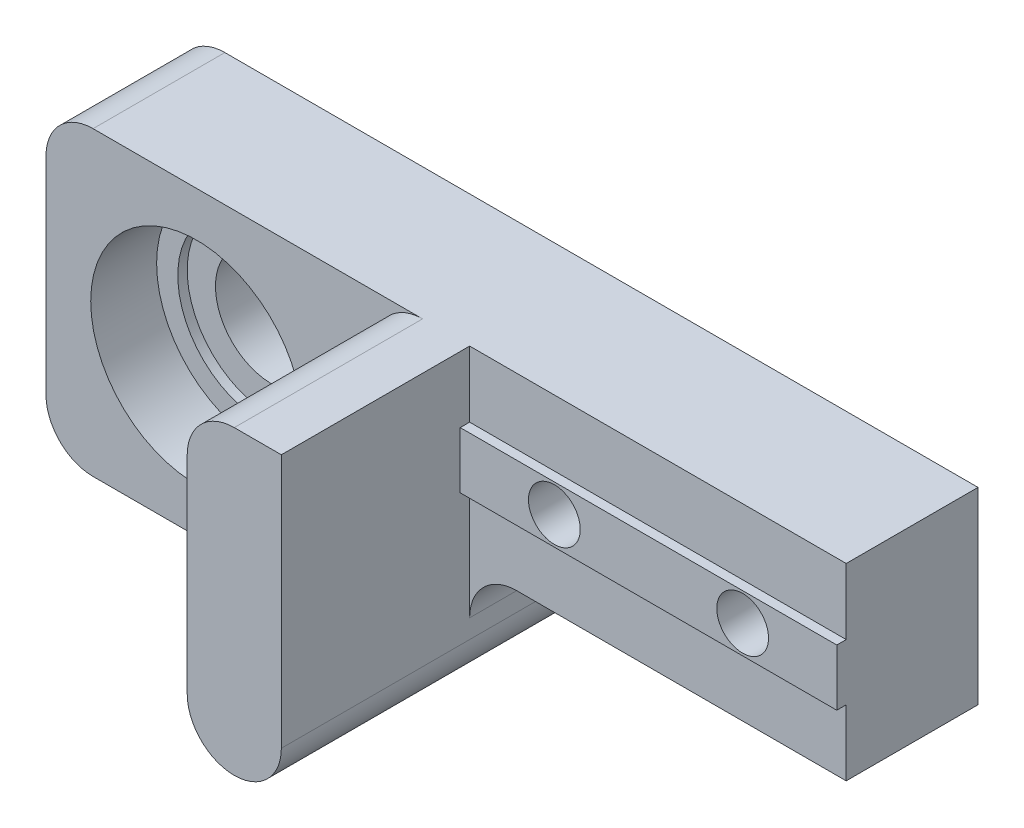
ISO-10303-21;
HEADER;
FILE_DESCRIPTION(('STEP AP214'),'2;1');
FILE_NAME('part.step','',(''),(''),'','','');
FILE_SCHEMA(('AUTOMOTIVE_DESIGN { 1 0 10303 214 1 1 1 1 }'));
ENDSEC;
DATA;
#1=APPLICATION_CONTEXT('core data for automotive mechanical design processes');
#2=APPLICATION_PROTOCOL_DEFINITION('international standard','automotive_design',2000,#1);
#3=PRODUCT_CONTEXT('',#1,'mechanical');
#4=PRODUCT('Part','Part','',(#3));
#5=PRODUCT_RELATED_PRODUCT_CATEGORY('part','',(#4));
#6=PRODUCT_DEFINITION_FORMATION('','',#4);
#7=PRODUCT_DEFINITION_CONTEXT('part definition',#1,'design');
#8=PRODUCT_DEFINITION('design','',#6,#7);
#9=PRODUCT_DEFINITION_SHAPE('','',#8);
#10=(LENGTH_UNIT() NAMED_UNIT(*) SI_UNIT(.MILLI.,.METRE.));
#11=(NAMED_UNIT(*) PLANE_ANGLE_UNIT() SI_UNIT($,.RADIAN.));
#12=(NAMED_UNIT(*) SI_UNIT($,.STERADIAN.) SOLID_ANGLE_UNIT());
#13=UNCERTAINTY_MEASURE_WITH_UNIT(LENGTH_MEASURE(1.E-05),#10,'distance_accuracy_value','');
#14=(GEOMETRIC_REPRESENTATION_CONTEXT(3) GLOBAL_UNCERTAINTY_ASSIGNED_CONTEXT((#13)) GLOBAL_UNIT_ASSIGNED_CONTEXT((#10,
#11,#12)) REPRESENTATION_CONTEXT('',''));
#15=CARTESIAN_POINT('',(0.,0.,0.));
#16=DIRECTION('',(0.,0.,1.));
#17=DIRECTION('',(1.,0.,0.));
#18=AXIS2_PLACEMENT_3D('',#15,#16,#17);
#19=CARTESIAN_POINT('',(-10.,-10.,40.));
#20=DIRECTION('',(0.,0.,-1.));
#21=DIRECTION('',(-1.,0.,0.));
#22=AXIS2_PLACEMENT_3D('',#19,#20,#21);
#23=CYLINDRICAL_SURFACE('',#22,2.75);
#24=CARTESIAN_POINT('',(-10.,-10.,15.));
#25=DIRECTION('',(0.,0.,-1.));
#26=DIRECTION('',(-1.,0.,0.));
#27=AXIS2_PLACEMENT_3D('',#24,#25,#26);
#28=CIRCLE('',#27,2.75);
#29=CARTESIAN_POINT('',(-12.75,-10.,15.));
#30=VERTEX_POINT('',#29);
#31=EDGE_CURVE('E330',#30,#30,#28,.T.);
#32=ORIENTED_EDGE('',*,*,#31,.F.);
#33=EDGE_LOOP('',(#32));
#34=FACE_BOUND('',#33,.T.);
#35=CARTESIAN_POINT('',(-10.,-10.,8.));
#36=DIRECTION('',(0.,0.,-1.));
#37=DIRECTION('',(-1.,0.,0.));
#38=AXIS2_PLACEMENT_3D('',#35,#36,#37);
#39=CIRCLE('',#38,2.75);
#40=CARTESIAN_POINT('',(-12.75,-10.,8.));
#41=VERTEX_POINT('',#40);
#42=EDGE_CURVE('E43',#41,#41,#39,.F.);
#43=ORIENTED_EDGE('',*,*,#42,.F.);
#44=EDGE_LOOP('',(#43));
#45=FACE_BOUND('',#44,.T.);
#46=ADVANCED_FACE('F39',(#34,#45),#23,.F.);
#47=CARTESIAN_POINT('',(-30.,-10.,40.));
#48=DIRECTION('',(0.,0.,-1.));
#49=DIRECTION('',(-1.,0.,0.));
#50=AXIS2_PLACEMENT_3D('',#47,#48,#49);
#51=CYLINDRICAL_SURFACE('',#50,2.75);
#52=CARTESIAN_POINT('',(-30.,-10.,15.));
#53=DIRECTION('',(0.,0.,-1.));
#54=DIRECTION('',(-1.,0.,0.));
#55=AXIS2_PLACEMENT_3D('',#52,#53,#54);
#56=CIRCLE('',#55,2.75);
#57=CARTESIAN_POINT('',(-32.75,-10.,15.));
#58=VERTEX_POINT('',#57);
#59=EDGE_CURVE('E200',#58,#58,#56,.T.);
#60=ORIENTED_EDGE('',*,*,#59,.F.);
#61=EDGE_LOOP('',(#60));
#62=FACE_BOUND('',#61,.T.);
#63=CARTESIAN_POINT('',(-30.,-10.,8.));
#64=DIRECTION('',(0.,0.,-1.));
#65=DIRECTION('',(-1.,0.,0.));
#66=AXIS2_PLACEMENT_3D('',#63,#64,#65);
#67=CIRCLE('',#66,2.75);
#68=CARTESIAN_POINT('',(-32.75,-10.,8.));
#69=VERTEX_POINT('',#68);
#70=EDGE_CURVE('E334',#69,#69,#67,.F.);
#71=ORIENTED_EDGE('',*,*,#70,.F.);
#72=EDGE_LOOP('',(#71));
#73=FACE_BOUND('',#72,.T.);
#74=ADVANCED_FACE('F369',(#62,#73),#51,.F.);
#75=CARTESIAN_POINT('',(0.,0.,14.));
#76=DIRECTION('',(0.,0.,1.));
#77=DIRECTION('',(1.,0.,0.));
#78=AXIS2_PLACEMENT_3D('',#75,#76,#77);
#79=PLANE('',#78);
#80=DIRECTION('',(1.,0.,0.));
#81=VECTOR('',#80,1.);
#82=CARTESIAN_POINT('',(-40.,-7.,14.));
#83=LINE('',#82,#81);
#84=CARTESIAN_POINT('',(-40.,-7.,14.));
#85=VERTEX_POINT('',#84);
#86=CARTESIAN_POINT('',(0.,-7.,14.));
#87=VERTEX_POINT('',#86);
#88=EDGE_CURVE('E191',#85,#87,#83,.T.);
#89=ORIENTED_EDGE('',*,*,#88,.T.);
#90=DIRECTION('',(0.,1.,0.));
#91=VECTOR('',#90,1.);
#92=CARTESIAN_POINT('',(0.,-20.,14.));
#93=LINE('',#92,#91);
#94=CARTESIAN_POINT('',(0.,0.,14.));
#95=VERTEX_POINT('',#94);
#96=EDGE_CURVE('E247',#87,#95,#93,.T.);
#97=ORIENTED_EDGE('',*,*,#96,.T.);
#98=DIRECTION('',(-1.,0.,0.));
#99=VECTOR('',#98,1.);
#100=CARTESIAN_POINT('',(0.,0.,14.));
#101=LINE('',#100,#99);
#102=CARTESIAN_POINT('',(-40.,0.,14.));
#103=VERTEX_POINT('',#102);
#104=EDGE_CURVE('E248',#95,#103,#101,.T.);
#105=ORIENTED_EDGE('',*,*,#104,.T.);
#106=DIRECTION('',(0.,1.,0.));
#107=VECTOR('',#106,1.);
#108=CARTESIAN_POINT('',(-40.,-32.,14.));
#109=LINE('',#108,#107);
#110=EDGE_CURVE('E220',#85,#103,#109,.T.);
#111=ORIENTED_EDGE('',*,*,#110,.F.);
#112=EDGE_LOOP('',(#89,#97,#105,#111));
#113=FACE_BOUND('',#112,.T.);
#114=ADVANCED_FACE('F376',(#113),#79,.T.);
#115=DIRECTION('',(0.,-1.,0.));
#116=VECTOR('',#115,1.);
#117=CARTESIAN_POINT('',(-85.,0.,14.));
#118=LINE('',#117,#116);
#119=CARTESIAN_POINT('',(-85.,-5.00000000000001,14.));
#120=VERTEX_POINT('',#119);
#121=CARTESIAN_POINT('',(-85.,-27.,14.));
#122=VERTEX_POINT('',#121);
#123=EDGE_CURVE('E251',#120,#122,#118,.T.);
#124=ORIENTED_EDGE('',*,*,#123,.T.);
#125=CARTESIAN_POINT('',(-80.,-27.,14.));
#126=DIRECTION('',(0.,0.,1.));
#127=DIRECTION('',(1.,0.,0.));
#128=AXIS2_PLACEMENT_3D('',#125,#126,#127);
#129=CIRCLE('',#128,5.);
#130=CARTESIAN_POINT('',(-80.,-32.,14.));
#131=VERTEX_POINT('',#130);
#132=EDGE_CURVE('E312',#122,#131,#129,.T.);
#133=ORIENTED_EDGE('',*,*,#132,.T.);
#134=DIRECTION('',(1.,0.,0.));
#135=VECTOR('',#134,1.);
#136=CARTESIAN_POINT('',(-85.,-32.,14.));
#137=LINE('',#136,#135);
#138=CARTESIAN_POINT('',(-45.,-32.,14.));
#139=VERTEX_POINT('',#138);
#140=EDGE_CURVE('E254',#131,#139,#137,.T.);
#141=ORIENTED_EDGE('',*,*,#140,.T.);
#142=CARTESIAN_POINT('',(-45.,-27.,14.));
#143=DIRECTION('',(0.,0.,1.));
#144=DIRECTION('',(1.,0.,0.));
#145=AXIS2_PLACEMENT_3D('',#142,#143,#144);
#146=CIRCLE('',#145,5.);
#147=CARTESIAN_POINT('',(-50.,-27.,14.));
#148=VERTEX_POINT('',#147);
#149=EDGE_CURVE('E48',#139,#148,#146,.F.);
#150=ORIENTED_EDGE('',*,*,#149,.T.);
#151=DIRECTION('',(0.,-1.,0.));
#152=VECTOR('',#151,1.);
#153=CARTESIAN_POINT('',(-50.,0.,14.));
#154=LINE('',#153,#152);
#155=CARTESIAN_POINT('',(-50.,-5.,14.));
#156=VERTEX_POINT('',#155);
#157=EDGE_CURVE('E210',#156,#148,#154,.T.);
#158=ORIENTED_EDGE('',*,*,#157,.F.);
#159=CARTESIAN_POINT('',(-45.,-5.,14.));
#160=DIRECTION('',(0.,0.,1.));
#161=DIRECTION('',(1.,0.,0.));
#162=AXIS2_PLACEMENT_3D('',#159,#160,#161);
#163=CIRCLE('',#162,5.);
#164=CARTESIAN_POINT('',(-45.,0.,14.));
#165=VERTEX_POINT('',#164);
#166=EDGE_CURVE('E11',#156,#165,#163,.F.);
#167=ORIENTED_EDGE('',*,*,#166,.T.);
#168=CARTESIAN_POINT('',(-80.,0.,14.));
#169=VERTEX_POINT('',#168);
#170=EDGE_CURVE('E246',#165,#169,#101,.T.);
#171=ORIENTED_EDGE('',*,*,#170,.T.);
#172=CARTESIAN_POINT('',(-80.,-5.00000000000001,14.));
#173=DIRECTION('',(0.,0.,1.));
#174=DIRECTION('',(1.,0.,0.));
#175=AXIS2_PLACEMENT_3D('',#172,#173,#174);
#176=CIRCLE('',#175,5.);
#177=EDGE_CURVE('E310',#169,#120,#176,.T.);
#178=ORIENTED_EDGE('',*,*,#177,.T.);
#179=EDGE_LOOP('',(#124,#133,#141,#150,#158,#167,#171,#178));
#180=FACE_BOUND('',#179,.T.);
#181=CARTESIAN_POINT('',(-69.,-16.,14.));
#182=DIRECTION('',(0.,0.,1.));
#183=DIRECTION('',(1.,0.,0.));
#184=AXIS2_PLACEMENT_3D('',#181,#182,#183);
#185=CIRCLE('',#184,11.25);
#186=CARTESIAN_POINT('',(-57.75,-16.,14.));
#187=VERTEX_POINT('',#186);
#188=EDGE_CURVE('E235',#187,#187,#185,.T.);
#189=ORIENTED_EDGE('',*,*,#188,.F.);
#190=EDGE_LOOP('',(#189));
#191=FACE_BOUND('',#190,.T.);
#192=ADVANCED_FACE('F425',(#180,#191),#79,.T.);
#193=CARTESIAN_POINT('',(0.,-20.,14.));
#194=DIRECTION('',(-1.,0.,0.));
#195=DIRECTION('',(0.,0.,1.));
#196=AXIS2_PLACEMENT_3D('',#193,#194,#195);
#197=PLANE('',#196);
#198=DIRECTION('',(0.,1.,0.));
#199=VECTOR('',#198,1.);
#200=CARTESIAN_POINT('',(0.,-20.,0.));
#201=LINE('',#200,#199);
#202=CARTESIAN_POINT('',(0.,-20.,0.));
#203=VERTEX_POINT('',#202);
#204=CARTESIAN_POINT('',(0.,0.,0.));
#205=VERTEX_POINT('',#204);
#206=EDGE_CURVE('E241',#203,#205,#201,.T.);
#207=ORIENTED_EDGE('',*,*,#206,.T.);
#208=DIRECTION('',(0.,0.,-1.));
#209=VECTOR('',#208,1.);
#210=CARTESIAN_POINT('',(0.,0.,14.));
#211=LINE('',#210,#209);
#212=EDGE_CURVE('E276',#95,#205,#211,.T.);
#213=ORIENTED_EDGE('',*,*,#212,.F.);
#214=ORIENTED_EDGE('',*,*,#96,.F.);
#215=DIRECTION('',(0.,0.,-1.));
#216=VECTOR('',#215,1.);
#217=CARTESIAN_POINT('',(0.,-7.,15.));
#218=LINE('',#217,#216);
#219=CARTESIAN_POINT('',(0.,-7.,15.));
#220=VERTEX_POINT('',#219);
#221=EDGE_CURVE('E190',#220,#87,#218,.T.);
#222=ORIENTED_EDGE('',*,*,#221,.F.);
#223=DIRECTION('',(0.,-1.,0.));
#224=VECTOR('',#223,1.);
#225=CARTESIAN_POINT('',(0.,-7.,15.));
#226=LINE('',#225,#224);
#227=CARTESIAN_POINT('',(0.,-13.,15.));
#228=VERTEX_POINT('',#227);
#229=EDGE_CURVE('E183',#220,#228,#226,.T.);
#230=ORIENTED_EDGE('',*,*,#229,.T.);
#231=DIRECTION('',(0.,0.,-1.));
#232=VECTOR('',#231,1.);
#233=CARTESIAN_POINT('',(0.,-13.,15.));
#234=LINE('',#233,#232);
#235=CARTESIAN_POINT('',(0.,-13.,14.));
#236=VERTEX_POINT('',#235);
#237=EDGE_CURVE('E169',#228,#236,#234,.T.);
#238=ORIENTED_EDGE('',*,*,#237,.T.);
#239=CARTESIAN_POINT('',(0.,-20.,14.));
#240=VERTEX_POINT('',#239);
#241=EDGE_CURVE('E244',#240,#236,#93,.T.);
#242=ORIENTED_EDGE('',*,*,#241,.F.);
#243=DIRECTION('',(0.,0.,-1.));
#244=VECTOR('',#243,1.);
#245=CARTESIAN_POINT('',(0.,-20.,14.));
#246=LINE('',#245,#244);
#247=EDGE_CURVE('E258',#240,#203,#246,.T.);
#248=ORIENTED_EDGE('',*,*,#247,.T.);
#249=EDGE_LOOP('',(#207,#213,#214,#222,#230,#238,#242,#248));
#250=FACE_BOUND('',#249,.T.);
#251=ADVANCED_FACE('F187',(#250),#197,.F.);
#252=CARTESIAN_POINT('',(0.,0.,14.));
#253=DIRECTION('',(0.,-1.,0.));
#254=DIRECTION('',(1.,0.,0.));
#255=AXIS2_PLACEMENT_3D('',#252,#253,#254);
#256=PLANE('',#255);
#257=DIRECTION('',(-1.,0.,0.));
#258=VECTOR('',#257,1.);
#259=CARTESIAN_POINT('',(0.,0.,0.));
#260=LINE('',#259,#258);
#261=CARTESIAN_POINT('',(-80.,0.,0.));
#262=VERTEX_POINT('',#261);
#263=EDGE_CURVE('E260',#205,#262,#260,.T.);
#264=ORIENTED_EDGE('',*,*,#263,.T.);
#265=DIRECTION('',(0.,0.,-1.));
#266=VECTOR('',#265,1.);
#267=CARTESIAN_POINT('',(-80.,0.,14.));
#268=LINE('',#267,#266);
#269=EDGE_CURVE('E316',#262,#169,#268,.F.);
#270=ORIENTED_EDGE('',*,*,#269,.T.);
#271=ORIENTED_EDGE('',*,*,#170,.F.);
#272=DIRECTION('',(0.,0.,-1.));
#273=VECTOR('',#272,1.);
#274=CARTESIAN_POINT('',(-45.,0.,14.));
#275=LINE('',#274,#273);
#276=CARTESIAN_POINT('',(-45.,0.,34.));
#277=VERTEX_POINT('',#276);
#278=EDGE_CURVE('E314',#165,#277,#275,.F.);
#279=ORIENTED_EDGE('',*,*,#278,.T.);
#280=DIRECTION('',(-1.,0.,0.));
#281=VECTOR('',#280,1.);
#282=CARTESIAN_POINT('',(-40.,0.,34.));
#283=LINE('',#282,#281);
#284=CARTESIAN_POINT('',(-40.,0.,34.));
#285=VERTEX_POINT('',#284);
#286=EDGE_CURVE('E209',#285,#277,#283,.T.);
#287=ORIENTED_EDGE('',*,*,#286,.F.);
#288=DIRECTION('',(0.,0.,-1.));
#289=VECTOR('',#288,1.);
#290=CARTESIAN_POINT('',(-40.,0.,34.));
#291=LINE('',#290,#289);
#292=EDGE_CURVE('E216',#285,#103,#291,.T.);
#293=ORIENTED_EDGE('',*,*,#292,.T.);
#294=ORIENTED_EDGE('',*,*,#104,.F.);
#295=ORIENTED_EDGE('',*,*,#212,.T.);
#296=EDGE_LOOP('',(#264,#270,#271,#279,#287,#293,#294,#295));
#297=FACE_BOUND('',#296,.T.);
#298=ADVANCED_FACE('F442',(#297),#256,.F.);
#299=CARTESIAN_POINT('',(-85.,0.,14.));
#300=DIRECTION('',(1.,0.,0.));
#301=DIRECTION('',(0.,0.,-1.));
#302=AXIS2_PLACEMENT_3D('',#299,#300,#301);
#303=PLANE('',#302);
#304=DIRECTION('',(0.,-1.,0.));
#305=VECTOR('',#304,1.);
#306=CARTESIAN_POINT('',(-85.,0.,0.));
#307=LINE('',#306,#305);
#308=CARTESIAN_POINT('',(-85.,-5.00000000000001,0.));
#309=VERTEX_POINT('',#308);
#310=CARTESIAN_POINT('',(-85.,-27.,0.));
#311=VERTEX_POINT('',#310);
#312=EDGE_CURVE('E263',#309,#311,#307,.T.);
#313=ORIENTED_EDGE('',*,*,#312,.T.);
#314=DIRECTION('',(0.,0.,-1.));
#315=VECTOR('',#314,1.);
#316=CARTESIAN_POINT('',(-85.,-27.,14.));
#317=LINE('',#316,#315);
#318=EDGE_CURVE('E308',#311,#122,#317,.F.);
#319=ORIENTED_EDGE('',*,*,#318,.T.);
#320=ORIENTED_EDGE('',*,*,#123,.F.);
#321=DIRECTION('',(0.,0.,-1.));
#322=VECTOR('',#321,1.);
#323=CARTESIAN_POINT('',(-85.,-5.00000000000001,14.));
#324=LINE('',#323,#322);
#325=EDGE_CURVE('E305',#120,#309,#324,.T.);
#326=ORIENTED_EDGE('',*,*,#325,.T.);
#327=EDGE_LOOP('',(#313,#319,#320,#326));
#328=FACE_BOUND('',#327,.T.);
#329=ADVANCED_FACE('F438',(#328),#303,.F.);
#330=CARTESIAN_POINT('',(-85.,-32.,14.));
#331=DIRECTION('',(0.,1.,0.));
#332=DIRECTION('',(-1.,0.,0.));
#333=AXIS2_PLACEMENT_3D('',#330,#331,#332);
#334=PLANE('',#333);
#335=ORIENTED_EDGE('',*,*,#140,.F.);
#336=DIRECTION('',(0.,0.,-1.));
#337=VECTOR('',#336,1.);
#338=CARTESIAN_POINT('',(-80.,-32.,14.));
#339=LINE('',#338,#337);
#340=CARTESIAN_POINT('',(-80.,-32.,0.));
#341=VERTEX_POINT('',#340);
#342=EDGE_CURVE('E293',#131,#341,#339,.T.);
#343=ORIENTED_EDGE('',*,*,#342,.T.);
#344=DIRECTION('',(1.,0.,0.));
#345=VECTOR('',#344,1.);
#346=CARTESIAN_POINT('',(-85.,-32.,0.));
#347=LINE('',#346,#345);
#348=CARTESIAN_POINT('',(-45.,-32.,0.));
#349=VERTEX_POINT('',#348);
#350=EDGE_CURVE('E266',#341,#349,#347,.T.);
#351=ORIENTED_EDGE('',*,*,#350,.T.);
#352=DIRECTION('',(0.,0.,-1.));
#353=VECTOR('',#352,1.);
#354=CARTESIAN_POINT('',(-45.,-32.,14.));
#355=LINE('',#354,#353);
#356=EDGE_CURVE('E290',#349,#139,#355,.F.);
#357=ORIENTED_EDGE('',*,*,#356,.T.);
#358=EDGE_LOOP('',(#335,#343,#351,#357));
#359=FACE_BOUND('',#358,.T.);
#360=ADVANCED_FACE('F435',(#359),#334,.F.);
#361=CARTESIAN_POINT('',(-40.,-32.,14.));
#362=DIRECTION('',(-1.,0.,0.));
#363=DIRECTION('',(0.,0.,1.));
#364=AXIS2_PLACEMENT_3D('',#361,#362,#363);
#365=PLANE('',#364);
#366=DIRECTION('',(0.,1.,0.));
#367=VECTOR('',#366,1.);
#368=CARTESIAN_POINT('',(-40.,-13.,15.));
#369=LINE('',#368,#367);
#370=CARTESIAN_POINT('',(-40.,-13.,15.));
#371=VERTEX_POINT('',#370);
#372=CARTESIAN_POINT('',(-40.,-7.,15.));
#373=VERTEX_POINT('',#372);
#374=EDGE_CURVE('E60',#371,#373,#369,.T.);
#375=ORIENTED_EDGE('',*,*,#374,.T.);
#376=DIRECTION('',(0.,0.,-1.));
#377=VECTOR('',#376,1.);
#378=CARTESIAN_POINT('',(-40.,-7.,15.));
#379=LINE('',#378,#377);
#380=EDGE_CURVE('E204',#373,#85,#379,.T.);
#381=ORIENTED_EDGE('',*,*,#380,.T.);
#382=ORIENTED_EDGE('',*,*,#110,.T.);
#383=ORIENTED_EDGE('',*,*,#292,.F.);
#384=DIRECTION('',(0.,1.,0.));
#385=VECTOR('',#384,1.);
#386=CARTESIAN_POINT('',(-40.,-32.,34.));
#387=LINE('',#386,#385);
#388=CARTESIAN_POINT('',(-40.,-27.,34.));
#389=VERTEX_POINT('',#388);
#390=EDGE_CURVE('E207',#389,#285,#387,.T.);
#391=ORIENTED_EDGE('',*,*,#390,.F.);
#392=DIRECTION('',(0.,0.,-1.));
#393=VECTOR('',#392,1.);
#394=CARTESIAN_POINT('',(-40.,-27.,14.));
#395=LINE('',#394,#393);
#396=CARTESIAN_POINT('',(-40.,-27.,0.));
#397=VERTEX_POINT('',#396);
#398=EDGE_CURVE('E281',#389,#397,#395,.T.);
#399=ORIENTED_EDGE('',*,*,#398,.T.);
#400=DIRECTION('',(0.,1.,0.));
#401=VECTOR('',#400,1.);
#402=CARTESIAN_POINT('',(-40.,-32.,0.));
#403=LINE('',#402,#401);
#404=CARTESIAN_POINT('',(-40.,-25.,0.));
#405=VERTEX_POINT('',#404);
#406=EDGE_CURVE('E269',#397,#405,#403,.T.);
#407=ORIENTED_EDGE('',*,*,#406,.T.);
#408=DIRECTION('',(0.,0.,-1.));
#409=VECTOR('',#408,1.);
#410=CARTESIAN_POINT('',(-40.,-25.,14.));
#411=LINE('',#410,#409);
#412=CARTESIAN_POINT('',(-40.,-25.,14.));
#413=VERTEX_POINT('',#412);
#414=EDGE_CURVE('E219',#405,#413,#411,.F.);
#415=ORIENTED_EDGE('',*,*,#414,.T.);
#416=CARTESIAN_POINT('',(-40.,-13.,14.));
#417=VERTEX_POINT('',#416);
#418=EDGE_CURVE('E217',#413,#417,#109,.T.);
#419=ORIENTED_EDGE('',*,*,#418,.T.);
#420=DIRECTION('',(0.,0.,-1.));
#421=VECTOR('',#420,1.);
#422=CARTESIAN_POINT('',(-40.,-13.,15.));
#423=LINE('',#422,#421);
#424=EDGE_CURVE('E56',#371,#417,#423,.T.);
#425=ORIENTED_EDGE('',*,*,#424,.F.);
#426=EDGE_LOOP('',(#375,#381,#382,#383,#391,#399,#407,#415,#419,#425));
#427=FACE_BOUND('',#426,.T.);
#428=ADVANCED_FACE('F431',(#427),#365,.F.);
#429=CARTESIAN_POINT('',(-40.,-20.,14.));
#430=DIRECTION('',(0.,1.,0.));
#431=DIRECTION('',(0.,0.,1.));
#432=AXIS2_PLACEMENT_3D('',#429,#430,#431);
#433=PLANE('',#432);
#434=DIRECTION('',(1.,0.,0.));
#435=VECTOR('',#434,1.);
#436=CARTESIAN_POINT('',(-40.,-20.,14.));
#437=LINE('',#436,#435);
#438=CARTESIAN_POINT('',(-35.,-20.,14.));
#439=VERTEX_POINT('',#438);
#440=EDGE_CURVE('E256',#439,#240,#437,.T.);
#441=ORIENTED_EDGE('',*,*,#440,.F.);
#442=DIRECTION('',(0.,0.,-1.));
#443=VECTOR('',#442,1.);
#444=CARTESIAN_POINT('',(-35.,-20.,0.));
#445=LINE('',#444,#443);
#446=CARTESIAN_POINT('',(-35.,-20.,0.));
#447=VERTEX_POINT('',#446);
#448=EDGE_CURVE('E302',#439,#447,#445,.T.);
#449=ORIENTED_EDGE('',*,*,#448,.T.);
#450=DIRECTION('',(1.,0.,0.));
#451=VECTOR('',#450,1.);
#452=CARTESIAN_POINT('',(-40.,-20.,0.));
#453=LINE('',#452,#451);
#454=EDGE_CURVE('E272',#447,#203,#453,.T.);
#455=ORIENTED_EDGE('',*,*,#454,.T.);
#456=ORIENTED_EDGE('',*,*,#247,.F.);
#457=EDGE_LOOP('',(#441,#449,#455,#456));
#458=FACE_BOUND('',#457,.T.);
#459=ADVANCED_FACE('F423',(#458),#433,.F.);
#460=DIRECTION('',(-1.,0.,0.));
#461=VECTOR('',#460,1.);
#462=CARTESIAN_POINT('',(0.,-13.,14.));
#463=LINE('',#462,#461);
#464=EDGE_CURVE('E173',#236,#417,#463,.T.);
#465=ORIENTED_EDGE('',*,*,#464,.T.);
#466=ORIENTED_EDGE('',*,*,#418,.F.);
#467=CARTESIAN_POINT('',(-35.,-25.,14.));
#468=DIRECTION('',(0.,0.,1.));
#469=DIRECTION('',(1.,0.,0.));
#470=AXIS2_PLACEMENT_3D('',#467,#468,#469);
#471=CIRCLE('',#470,5.);
#472=EDGE_CURVE('E325',#413,#439,#471,.F.);
#473=ORIENTED_EDGE('',*,*,#472,.T.);
#474=ORIENTED_EDGE('',*,*,#440,.T.);
#475=ORIENTED_EDGE('',*,*,#241,.T.);
#476=EDGE_LOOP('',(#465,#466,#473,#474,#475));
#477=FACE_BOUND('',#476,.T.);
#478=ADVANCED_FACE('F420',(#477),#79,.T.);
#479=CARTESIAN_POINT('',(0.,0.,0.));
#480=DIRECTION('',(0.,0.,1.));
#481=DIRECTION('',(1.,0.,0.));
#482=AXIS2_PLACEMENT_3D('',#479,#480,#481);
#483=PLANE('',#482);
#484=CARTESIAN_POINT('',(-10.,-10.,0.));
#485=DIRECTION('',(0.,0.,-1.));
#486=DIRECTION('',(-1.,0.,0.));
#487=AXIS2_PLACEMENT_3D('',#484,#485,#486);
#488=CIRCLE('',#487,6.);
#489=CARTESIAN_POINT('',(-16.,-10.,0.));
#490=VERTEX_POINT('',#489);
#491=EDGE_CURVE('E341',#490,#490,#488,.T.);
#492=ORIENTED_EDGE('',*,*,#491,.F.);
#493=EDGE_LOOP('',(#492));
#494=FACE_BOUND('',#493,.T.);
#495=CARTESIAN_POINT('',(-30.,-10.,0.));
#496=DIRECTION('',(0.,0.,-1.));
#497=DIRECTION('',(-1.,0.,0.));
#498=AXIS2_PLACEMENT_3D('',#495,#496,#497);
#499=CIRCLE('',#498,6.);
#500=CARTESIAN_POINT('',(-36.,-10.,0.));
#501=VERTEX_POINT('',#500);
#502=EDGE_CURVE('E346',#501,#501,#499,.T.);
#503=ORIENTED_EDGE('',*,*,#502,.F.);
#504=EDGE_LOOP('',(#503));
#505=FACE_BOUND('',#504,.T.);
#506=CARTESIAN_POINT('',(-69.,-16.,0.));
#507=DIRECTION('',(0.,0.,1.));
#508=DIRECTION('',(1.,0.,0.));
#509=AXIS2_PLACEMENT_3D('',#506,#507,#508);
#510=CIRCLE('',#509,6.);
#511=CARTESIAN_POINT('',(-63.,-16.,0.));
#512=VERTEX_POINT('',#511);
#513=EDGE_CURVE('E228',#512,#512,#510,.F.);
#514=ORIENTED_EDGE('',*,*,#513,.F.);
#515=EDGE_LOOP('',(#514));
#516=FACE_BOUND('',#515,.T.);
#517=ORIENTED_EDGE('',*,*,#406,.F.);
#518=CARTESIAN_POINT('',(-45.,-27.,0.));
#519=DIRECTION('',(0.,0.,1.));
#520=DIRECTION('',(1.,0.,0.));
#521=AXIS2_PLACEMENT_3D('',#518,#519,#520);
#522=CIRCLE('',#521,5.);
#523=EDGE_CURVE('E288',#397,#349,#522,.F.);
#524=ORIENTED_EDGE('',*,*,#523,.T.);
#525=ORIENTED_EDGE('',*,*,#350,.F.);
#526=CARTESIAN_POINT('',(-80.,-27.,0.));
#527=DIRECTION('',(0.,0.,1.));
#528=DIRECTION('',(1.,0.,0.));
#529=AXIS2_PLACEMENT_3D('',#526,#527,#528);
#530=CIRCLE('',#529,5.);
#531=EDGE_CURVE('E286',#341,#311,#530,.F.);
#532=ORIENTED_EDGE('',*,*,#531,.T.);
#533=ORIENTED_EDGE('',*,*,#312,.F.);
#534=CARTESIAN_POINT('',(-80.,-5.00000000000001,0.));
#535=DIRECTION('',(0.,0.,1.));
#536=DIRECTION('',(1.,0.,0.));
#537=AXIS2_PLACEMENT_3D('',#534,#535,#536);
#538=CIRCLE('',#537,5.);
#539=EDGE_CURVE('E284',#309,#262,#538,.F.);
#540=ORIENTED_EDGE('',*,*,#539,.T.);
#541=ORIENTED_EDGE('',*,*,#263,.F.);
#542=ORIENTED_EDGE('',*,*,#206,.F.);
#543=ORIENTED_EDGE('',*,*,#454,.F.);
#544=CARTESIAN_POINT('',(-35.,-25.,0.));
#545=DIRECTION('',(0.,0.,1.));
#546=DIRECTION('',(1.,0.,0.));
#547=AXIS2_PLACEMENT_3D('',#544,#545,#546);
#548=CIRCLE('',#547,5.);
#549=EDGE_CURVE('E323',#447,#405,#548,.T.);
#550=ORIENTED_EDGE('',*,*,#549,.T.);
#551=EDGE_LOOP('',(#517,#524,#525,#532,#533,#540,#541,#542,#543,#550));
#552=FACE_BOUND('',#551,.T.);
#553=ADVANCED_FACE('F418',(#494,#505,#516,#552),#483,.F.);
#554=CARTESIAN_POINT('',(-69.,-16.,7.));
#555=DIRECTION('',(0.,0.,1.));
#556=DIRECTION('',(1.,0.,0.));
#557=AXIS2_PLACEMENT_3D('',#554,#555,#556);
#558=CYLINDRICAL_SURFACE('',#557,11.25);
#559=CARTESIAN_POINT('',(-69.,-16.,7.));
#560=DIRECTION('',(0.,0.,1.));
#561=DIRECTION('',(1.,0.,0.));
#562=AXIS2_PLACEMENT_3D('',#559,#560,#561);
#563=CIRCLE('',#562,11.25);
#564=CARTESIAN_POINT('',(-57.75,-16.,7.));
#565=VERTEX_POINT('',#564);
#566=EDGE_CURVE('E238',#565,#565,#563,.T.);
#567=ORIENTED_EDGE('',*,*,#566,.F.);
#568=EDGE_LOOP('',(#567));
#569=FACE_BOUND('',#568,.T.);
#570=ORIENTED_EDGE('',*,*,#188,.T.);
#571=EDGE_LOOP('',(#570));
#572=FACE_BOUND('',#571,.T.);
#573=ADVANCED_FACE('F414',(#569,#572),#558,.F.);
#574=CARTESIAN_POINT('',(-69.,-16.,7.));
#575=DIRECTION('',(0.,0.,1.));
#576=DIRECTION('',(1.,0.,0.));
#577=AXIS2_PLACEMENT_3D('',#574,#575,#576);
#578=PLANE('',#577);
#579=CARTESIAN_POINT('',(-69.,-16.,7.));
#580=DIRECTION('',(0.,0.,1.));
#581=DIRECTION('',(1.,0.,0.));
#582=AXIS2_PLACEMENT_3D('',#579,#580,#581);
#583=CIRCLE('',#582,9.);
#584=CARTESIAN_POINT('',(-60.,-16.,7.));
#585=VERTEX_POINT('',#584);
#586=EDGE_CURVE('E231',#585,#585,#583,.T.);
#587=ORIENTED_EDGE('',*,*,#586,.F.);
#588=EDGE_LOOP('',(#587));
#589=FACE_BOUND('',#588,.T.);
#590=ORIENTED_EDGE('',*,*,#566,.T.);
#591=EDGE_LOOP('',(#590));
#592=FACE_BOUND('',#591,.T.);
#593=ADVANCED_FACE('F410',(#589,#592),#578,.T.);
#594=CARTESIAN_POINT('',(-69.,-16.,6.));
#595=DIRECTION('',(0.,0.,1.));
#596=DIRECTION('',(1.,0.,0.));
#597=AXIS2_PLACEMENT_3D('',#594,#595,#596);
#598=CYLINDRICAL_SURFACE('',#597,9.);
#599=CARTESIAN_POINT('',(-69.,-16.,6.));
#600=DIRECTION('',(0.,0.,1.));
#601=DIRECTION('',(1.,0.,0.));
#602=AXIS2_PLACEMENT_3D('',#599,#600,#601);
#603=CIRCLE('',#602,9.);
#604=CARTESIAN_POINT('',(-60.,-16.,6.));
#605=VERTEX_POINT('',#604);
#606=EDGE_CURVE('E232',#605,#605,#603,.T.);
#607=ORIENTED_EDGE('',*,*,#606,.F.);
#608=EDGE_LOOP('',(#607));
#609=FACE_BOUND('',#608,.T.);
#610=ORIENTED_EDGE('',*,*,#586,.T.);
#611=EDGE_LOOP('',(#610));
#612=FACE_BOUND('',#611,.T.);
#613=ADVANCED_FACE('F406',(#609,#612),#598,.F.);
#614=CARTESIAN_POINT('',(-69.,-16.,6.));
#615=DIRECTION('',(0.,0.,1.));
#616=DIRECTION('',(1.,0.,0.));
#617=AXIS2_PLACEMENT_3D('',#614,#615,#616);
#618=PLANE('',#617);
#619=CARTESIAN_POINT('',(-69.,-16.,6.));
#620=DIRECTION('',(0.,0.,1.));
#621=DIRECTION('',(1.,0.,0.));
#622=AXIS2_PLACEMENT_3D('',#619,#620,#621);
#623=CIRCLE('',#622,6.);
#624=CARTESIAN_POINT('',(-63.,-16.,6.));
#625=VERTEX_POINT('',#624);
#626=EDGE_CURVE('E225',#625,#625,#623,.T.);
#627=ORIENTED_EDGE('',*,*,#626,.F.);
#628=EDGE_LOOP('',(#627));
#629=FACE_BOUND('',#628,.T.);
#630=ORIENTED_EDGE('',*,*,#606,.T.);
#631=EDGE_LOOP('',(#630));
#632=FACE_BOUND('',#631,.T.);
#633=ADVANCED_FACE('F402',(#629,#632),#618,.T.);
#634=CARTESIAN_POINT('',(-69.,-16.,-0.00100000000000013));
#635=DIRECTION('',(0.,0.,1.));
#636=DIRECTION('',(1.,0.,0.));
#637=AXIS2_PLACEMENT_3D('',#634,#635,#636);
#638=CYLINDRICAL_SURFACE('',#637,6.);
#639=CARTESIAN_POINT('',(-63.,-16.,6.));
#640=CARTESIAN_POINT('',(-63.,-16.,5.9375));
#641=CARTESIAN_POINT('',(-63.,-16.,5.875));
#642=CARTESIAN_POINT('',(-63.,-16.,5.75));
#643=CARTESIAN_POINT('',(-63.,-16.,5.6875));
#644=CARTESIAN_POINT('',(-63.,-16.,5.5625));
#645=CARTESIAN_POINT('',(-63.,-16.,5.5));
#646=CARTESIAN_POINT('',(-63.,-16.,5.375));
#647=CARTESIAN_POINT('',(-63.,-16.,5.3125));
#648=CARTESIAN_POINT('',(-63.,-16.,5.1875));
#649=CARTESIAN_POINT('',(-63.,-16.,5.125));
#650=CARTESIAN_POINT('',(-63.,-16.,5.));
#651=CARTESIAN_POINT('',(-63.,-16.,4.9375));
#652=CARTESIAN_POINT('',(-63.,-16.,4.8125));
#653=CARTESIAN_POINT('',(-63.,-16.,4.75));
#654=CARTESIAN_POINT('',(-63.,-16.,4.625));
#655=CARTESIAN_POINT('',(-63.,-16.,4.5625));
#656=CARTESIAN_POINT('',(-63.,-16.,4.4375));
#657=CARTESIAN_POINT('',(-63.,-16.,4.375));
#658=CARTESIAN_POINT('',(-63.,-16.,4.25));
#659=CARTESIAN_POINT('',(-63.,-16.,4.1875));
#660=CARTESIAN_POINT('',(-63.,-16.,4.0625));
#661=CARTESIAN_POINT('',(-63.,-16.,4.));
#662=CARTESIAN_POINT('',(-63.,-16.,3.875));
#663=CARTESIAN_POINT('',(-63.,-16.,3.8125));
#664=CARTESIAN_POINT('',(-63.,-16.,3.6875));
#665=CARTESIAN_POINT('',(-63.,-16.,3.625));
#666=CARTESIAN_POINT('',(-63.,-16.,3.5));
#667=CARTESIAN_POINT('',(-63.,-16.,3.4375));
#668=CARTESIAN_POINT('',(-63.,-16.,3.3125));
#669=CARTESIAN_POINT('',(-63.,-16.,3.25));
#670=CARTESIAN_POINT('',(-63.,-16.,3.125));
#671=CARTESIAN_POINT('',(-63.,-16.,3.0625));
#672=CARTESIAN_POINT('',(-63.,-16.,2.9375));
#673=CARTESIAN_POINT('',(-63.,-16.,2.875));
#674=CARTESIAN_POINT('',(-63.,-16.,2.75));
#675=CARTESIAN_POINT('',(-63.,-16.,2.6875));
#676=CARTESIAN_POINT('',(-63.,-16.,2.5625));
#677=CARTESIAN_POINT('',(-63.,-16.,2.5));
#678=CARTESIAN_POINT('',(-63.,-16.,2.375));
#679=CARTESIAN_POINT('',(-63.,-16.,2.3125));
#680=CARTESIAN_POINT('',(-63.,-16.,2.1875));
#681=CARTESIAN_POINT('',(-63.,-16.,2.125));
#682=CARTESIAN_POINT('',(-63.,-16.,2.));
#683=CARTESIAN_POINT('',(-63.,-16.,1.9375));
#684=CARTESIAN_POINT('',(-63.,-16.,1.8125));
#685=CARTESIAN_POINT('',(-63.,-16.,1.75));
#686=CARTESIAN_POINT('',(-63.,-16.,1.625));
#687=CARTESIAN_POINT('',(-63.,-16.,1.5625));
#688=CARTESIAN_POINT('',(-63.,-16.,1.4375));
#689=CARTESIAN_POINT('',(-63.,-16.,1.375));
#690=CARTESIAN_POINT('',(-63.,-16.,1.25));
#691=CARTESIAN_POINT('',(-63.,-16.,1.1875));
#692=CARTESIAN_POINT('',(-63.,-16.,1.0625));
#693=CARTESIAN_POINT('',(-63.,-16.,1.));
#694=CARTESIAN_POINT('',(-63.,-16.,0.875));
#695=CARTESIAN_POINT('',(-63.,-16.,0.8125));
#696=CARTESIAN_POINT('',(-63.,-16.,0.6875));
#697=CARTESIAN_POINT('',(-63.,-16.,0.625));
#698=CARTESIAN_POINT('',(-63.,-16.,0.5));
#699=CARTESIAN_POINT('',(-63.,-16.,0.4375));
#700=CARTESIAN_POINT('',(-63.,-16.,0.3125));
#701=CARTESIAN_POINT('',(-63.,-16.,0.25));
#702=CARTESIAN_POINT('',(-63.,-16.,0.125));
#703=CARTESIAN_POINT('',(-63.,-16.,0.0625000000000001));
#704=CARTESIAN_POINT('',(-63.,-16.,0.));
#705=B_SPLINE_CURVE_WITH_KNOTS('',3,(#639,#640,#641,#642,#643,#644,#645,#646,#647,#648,#649,
#650,#651,#652,#653,#654,#655,#656,#657,#658,#659,#660,#661,#662,#663,#664,#665,#666,#667,#668,
#669,#670,#671,#672,#673,#674,#675,#676,#677,#678,#679,#680,#681,#682,#683,#684,#685,#686,#687,
#688,#689,#690,#691,#692,#693,#694,#695,#696,#697,#698,#699,#700,#701,#702,#703,#704),
.UNSPECIFIED.,.F.,.F.,(4,2,2,2,2,2,2,2,2,2,2,2,2,2,2,2,2,2,2,2,2,2,2,2,2,2,2,2,2,2,2,2,4),(0.,
0.1875,0.375,0.5625,0.75,0.9375,1.125,1.3125,1.5,1.6875,1.875,2.0625,2.25,2.4375,2.625,2.8125,
3.,3.1875,3.375,3.5625,3.75,3.9375,4.125,4.3125,4.5,4.6875,4.875,5.0625,5.25,5.4375,5.625,
5.8125,6.),.UNSPECIFIED.);
#706=EDGE_CURVE('BSEAM398',#625,#512,#705,.T.);
#707=ORIENTED_EDGE('',*,*,#626,.T.);
#708=ORIENTED_EDGE('',*,*,#513,.T.);
#709=ORIENTED_EDGE('',*,*,#706,.T.);
#710=ORIENTED_EDGE('',*,*,#706,.F.);
#711=EDGE_LOOP('',(#707,#709,#708,#710));
#712=FACE_BOUND('',#711,.T.);
#713=ADVANCED_FACE('F398',(#712),#638,.F.);
#714=CARTESIAN_POINT('',(-50.,0.,34.));
#715=DIRECTION('',(1.,0.,0.));
#716=DIRECTION('',(0.,1.,0.));
#717=AXIS2_PLACEMENT_3D('',#714,#715,#716);
#718=PLANE('',#717);
#719=ORIENTED_EDGE('',*,*,#157,.T.);
#720=DIRECTION('',(0.,0.,-1.));
#721=VECTOR('',#720,1.);
#722=CARTESIAN_POINT('',(-50.,-27.,34.));
#723=LINE('',#722,#721);
#724=CARTESIAN_POINT('',(-50.,-27.,34.));
#725=VERTEX_POINT('',#724);
#726=EDGE_CURVE('E321',#148,#725,#723,.F.);
#727=ORIENTED_EDGE('',*,*,#726,.T.);
#728=DIRECTION('',(0.,-1.,0.));
#729=VECTOR('',#728,1.);
#730=CARTESIAN_POINT('',(-50.,0.,34.));
#731=LINE('',#730,#729);
#732=CARTESIAN_POINT('',(-50.,-5.,34.));
#733=VERTEX_POINT('',#732);
#734=EDGE_CURVE('E213',#733,#725,#731,.T.);
#735=ORIENTED_EDGE('',*,*,#734,.F.);
#736=DIRECTION('',(0.,0.,-1.));
#737=VECTOR('',#736,1.);
#738=CARTESIAN_POINT('',(-50.,-5.,34.));
#739=LINE('',#738,#737);
#740=EDGE_CURVE('E318',#733,#156,#739,.T.);
#741=ORIENTED_EDGE('',*,*,#740,.T.);
#742=EDGE_LOOP('',(#719,#727,#735,#741));
#743=FACE_BOUND('',#742,.T.);
#744=ADVANCED_FACE('F394',(#743),#718,.F.);
#745=CARTESIAN_POINT('',(0.,0.,34.));
#746=DIRECTION('',(0.,0.,1.));
#747=DIRECTION('',(1.,0.,0.));
#748=AXIS2_PLACEMENT_3D('',#745,#746,#747);
#749=PLANE('',#748);
#750=CARTESIAN_POINT('',(-45.,-27.,34.));
#751=DIRECTION('',(0.,0.,1.));
#752=DIRECTION('',(1.,0.,0.));
#753=AXIS2_PLACEMENT_3D('',#750,#751,#752);
#754=CIRCLE('',#753,5.);
#755=CARTESIAN_POINT('',(-45.,-32.,34.));
#756=VERTEX_POINT('',#755);
#757=EDGE_CURVE('E298',#725,#756,#754,.T.);
#758=ORIENTED_EDGE('',*,*,#757,.T.);
#759=CARTESIAN_POINT('',(-45.,-27.,34.));
#760=DIRECTION('',(0.,0.,1.));
#761=DIRECTION('',(1.,0.,0.));
#762=AXIS2_PLACEMENT_3D('',#759,#760,#761);
#763=CIRCLE('',#762,5.);
#764=EDGE_CURVE('E300',#756,#389,#763,.T.);
#765=ORIENTED_EDGE('',*,*,#764,.T.);
#766=ORIENTED_EDGE('',*,*,#390,.T.);
#767=ORIENTED_EDGE('',*,*,#286,.T.);
#768=CARTESIAN_POINT('',(-45.,-5.,34.));
#769=DIRECTION('',(0.,0.,1.));
#770=DIRECTION('',(1.,0.,0.));
#771=AXIS2_PLACEMENT_3D('',#768,#769,#770);
#772=CIRCLE('',#771,5.);
#773=EDGE_CURVE('E296',#277,#733,#772,.T.);
#774=ORIENTED_EDGE('',*,*,#773,.T.);
#775=ORIENTED_EDGE('',*,*,#734,.T.);
#776=EDGE_LOOP('',(#758,#765,#766,#767,#774,#775));
#777=FACE_BOUND('',#776,.T.);
#778=ADVANCED_FACE('F390',(#777),#749,.T.);
#779=CARTESIAN_POINT('',(-45.,-27.,14.));
#780=DIRECTION('',(0.,0.,-1.));
#781=DIRECTION('',(-1.,0.,0.));
#782=AXIS2_PLACEMENT_3D('',#779,#780,#781);
#783=CYLINDRICAL_SURFACE('',#782,5.);
#784=ORIENTED_EDGE('',*,*,#726,.F.);
#785=ORIENTED_EDGE('',*,*,#149,.F.);
#786=DIRECTION('',(0.,0.,-1.));
#787=VECTOR('',#786,1.);
#788=CARTESIAN_POINT('',(-45.,-32.,14.));
#789=LINE('',#788,#787);
#790=EDGE_CURVE('E203',#756,#139,#789,.T.);
#791=ORIENTED_EDGE('',*,*,#790,.F.);
#792=ORIENTED_EDGE('',*,*,#757,.F.);
#793=EDGE_LOOP('',(#784,#785,#791,#792));
#794=FACE_BOUND('',#793,.T.);
#795=ADVANCED_FACE('F393',(#794),#783,.T.);
#796=CARTESIAN_POINT('',(-45.,-27.,14.));
#797=DIRECTION('',(0.,0.,-1.));
#798=DIRECTION('',(-1.,0.,0.));
#799=AXIS2_PLACEMENT_3D('',#796,#797,#798);
#800=CYLINDRICAL_SURFACE('',#799,5.);
#801=ORIENTED_EDGE('',*,*,#790,.T.);
#802=ORIENTED_EDGE('',*,*,#356,.F.);
#803=ORIENTED_EDGE('',*,*,#523,.F.);
#804=ORIENTED_EDGE('',*,*,#398,.F.);
#805=ORIENTED_EDGE('',*,*,#764,.F.);
#806=EDGE_LOOP('',(#801,#802,#803,#804,#805));
#807=FACE_BOUND('',#806,.T.);
#808=ADVANCED_FACE('F449',(#807),#800,.T.);
#809=CARTESIAN_POINT('',(-35.,-25.,14.));
#810=DIRECTION('',(0.,0.,1.));
#811=DIRECTION('',(1.,0.,0.));
#812=AXIS2_PLACEMENT_3D('',#809,#810,#811);
#813=CYLINDRICAL_SURFACE('',#812,5.);
#814=ORIENTED_EDGE('',*,*,#472,.F.);
#815=ORIENTED_EDGE('',*,*,#414,.F.);
#816=ORIENTED_EDGE('',*,*,#549,.F.);
#817=ORIENTED_EDGE('',*,*,#448,.F.);
#818=EDGE_LOOP('',(#814,#815,#816,#817));
#819=FACE_BOUND('',#818,.T.);
#820=ADVANCED_FACE('F452',(#819),#813,.F.);
#821=CARTESIAN_POINT('',(-80.,-27.,14.));
#822=DIRECTION('',(0.,0.,-1.));
#823=DIRECTION('',(-1.,0.,0.));
#824=AXIS2_PLACEMENT_3D('',#821,#822,#823);
#825=CYLINDRICAL_SURFACE('',#824,5.);
#826=ORIENTED_EDGE('',*,*,#132,.F.);
#827=ORIENTED_EDGE('',*,*,#318,.F.);
#828=ORIENTED_EDGE('',*,*,#531,.F.);
#829=ORIENTED_EDGE('',*,*,#342,.F.);
#830=EDGE_LOOP('',(#826,#827,#828,#829));
#831=FACE_BOUND('',#830,.T.);
#832=ADVANCED_FACE('F459',(#831),#825,.T.);
#833=CARTESIAN_POINT('',(-80.,-5.00000000000001,14.));
#834=DIRECTION('',(0.,0.,-1.));
#835=DIRECTION('',(-1.,0.,0.));
#836=AXIS2_PLACEMENT_3D('',#833,#834,#835);
#837=CYLINDRICAL_SURFACE('',#836,5.);
#838=ORIENTED_EDGE('',*,*,#177,.F.);
#839=ORIENTED_EDGE('',*,*,#269,.F.);
#840=ORIENTED_EDGE('',*,*,#539,.F.);
#841=ORIENTED_EDGE('',*,*,#325,.F.);
#842=EDGE_LOOP('',(#838,#839,#840,#841));
#843=FACE_BOUND('',#842,.T.);
#844=ADVANCED_FACE('F462',(#843),#837,.T.);
#845=CARTESIAN_POINT('',(-45.,-5.,34.));
#846=DIRECTION('',(0.,0.,-1.));
#847=DIRECTION('',(-1.,0.,0.));
#848=AXIS2_PLACEMENT_3D('',#845,#846,#847);
#849=CYLINDRICAL_SURFACE('',#848,5.);
#850=ORIENTED_EDGE('',*,*,#773,.F.);
#851=ORIENTED_EDGE('',*,*,#278,.F.);
#852=ORIENTED_EDGE('',*,*,#166,.F.);
#853=ORIENTED_EDGE('',*,*,#740,.F.);
#854=EDGE_LOOP('',(#850,#851,#852,#853));
#855=FACE_BOUND('',#854,.T.);
#856=ADVANCED_FACE('F41',(#855),#849,.T.);
#857=CARTESIAN_POINT('',(-40.,-7.,15.));
#858=DIRECTION('',(0.,1.,0.));
#859=DIRECTION('',(0.,0.,1.));
#860=AXIS2_PLACEMENT_3D('',#857,#858,#859);
#861=PLANE('',#860);
#862=ORIENTED_EDGE('',*,*,#88,.F.);
#863=ORIENTED_EDGE('',*,*,#380,.F.);
#864=DIRECTION('',(1.,0.,0.));
#865=VECTOR('',#864,1.);
#866=CARTESIAN_POINT('',(-40.,-7.,15.));
#867=LINE('',#866,#865);
#868=EDGE_CURVE('E177',#373,#220,#867,.T.);
#869=ORIENTED_EDGE('',*,*,#868,.T.);
#870=ORIENTED_EDGE('',*,*,#221,.T.);
#871=EDGE_LOOP('',(#862,#863,#869,#870));
#872=FACE_BOUND('',#871,.T.);
#873=ADVANCED_FACE('F384',(#872),#861,.T.);
#874=CARTESIAN_POINT('',(0.,-13.,15.));
#875=DIRECTION('',(0.,-1.,0.));
#876=DIRECTION('',(1.,0.,0.));
#877=AXIS2_PLACEMENT_3D('',#874,#875,#876);
#878=PLANE('',#877);
#879=ORIENTED_EDGE('',*,*,#464,.F.);
#880=ORIENTED_EDGE('',*,*,#237,.F.);
#881=DIRECTION('',(-1.,0.,0.));
#882=VECTOR('',#881,1.);
#883=CARTESIAN_POINT('',(0.,-13.,15.));
#884=LINE('',#883,#882);
#885=EDGE_CURVE('E172',#228,#371,#884,.T.);
#886=ORIENTED_EDGE('',*,*,#885,.T.);
#887=ORIENTED_EDGE('',*,*,#424,.T.);
#888=EDGE_LOOP('',(#879,#880,#886,#887));
#889=FACE_BOUND('',#888,.T.);
#890=ADVANCED_FACE('F171',(#889),#878,.T.);
#891=CARTESIAN_POINT('',(0.,0.,15.));
#892=DIRECTION('',(0.,0.,-1.));
#893=DIRECTION('',(-1.,0.,0.));
#894=AXIS2_PLACEMENT_3D('',#891,#892,#893);
#895=PLANE('',#894);
#896=ORIENTED_EDGE('',*,*,#59,.T.);
#897=EDGE_LOOP('',(#896));
#898=FACE_BOUND('',#897,.T.);
#899=ORIENTED_EDGE('',*,*,#31,.T.);
#900=EDGE_LOOP('',(#899));
#901=FACE_BOUND('',#900,.T.);
#902=ORIENTED_EDGE('',*,*,#229,.F.);
#903=ORIENTED_EDGE('',*,*,#868,.F.);
#904=ORIENTED_EDGE('',*,*,#374,.F.);
#905=ORIENTED_EDGE('',*,*,#885,.F.);
#906=EDGE_LOOP('',(#902,#903,#904,#905));
#907=FACE_BOUND('',#906,.T.);
#908=ADVANCED_FACE('F181',(#898,#901,#907),#895,.F.);
#909=CARTESIAN_POINT('',(-30.,-10.,8.));
#910=DIRECTION('',(0.,0.,-1.));
#911=DIRECTION('',(-1.,0.,0.));
#912=AXIS2_PLACEMENT_3D('',#909,#910,#911);
#913=PLANE('',#912);
#914=CARTESIAN_POINT('',(-30.,-10.,8.));
#915=DIRECTION('',(0.,0.,-1.));
#916=DIRECTION('',(-1.,0.,0.));
#917=AXIS2_PLACEMENT_3D('',#914,#915,#916);
#918=CIRCLE('',#917,6.);
#919=CARTESIAN_POINT('',(-36.,-10.,8.));
#920=VERTEX_POINT('',#919);
#921=EDGE_CURVE('E195',#920,#920,#918,.T.);
#922=ORIENTED_EDGE('',*,*,#921,.T.);
#923=EDGE_LOOP('',(#922));
#924=FACE_BOUND('',#923,.T.);
#925=ORIENTED_EDGE('',*,*,#70,.T.);
#926=EDGE_LOOP('',(#925));
#927=FACE_BOUND('',#926,.T.);
#928=ADVANCED_FACE('F354',(#924,#927),#913,.T.);
#929=CARTESIAN_POINT('',(-30.,-10.,8.));
#930=DIRECTION('',(0.,0.,-1.));
#931=DIRECTION('',(-1.,0.,0.));
#932=AXIS2_PLACEMENT_3D('',#929,#930,#931);
#933=CYLINDRICAL_SURFACE('',#932,6.);
#934=ORIENTED_EDGE('',*,*,#921,.F.);
#935=EDGE_LOOP('',(#934));
#936=FACE_BOUND('',#935,.T.);
#937=ORIENTED_EDGE('',*,*,#502,.T.);
#938=EDGE_LOOP('',(#937));
#939=FACE_BOUND('',#938,.T.);
#940=ADVANCED_FACE('F356',(#936,#939),#933,.F.);
#941=CARTESIAN_POINT('',(-10.,-10.,8.));
#942=DIRECTION('',(0.,0.,-1.));
#943=DIRECTION('',(-1.,0.,0.));
#944=AXIS2_PLACEMENT_3D('',#941,#942,#943);
#945=PLANE('',#944);
#946=CARTESIAN_POINT('',(-10.,-10.,8.));
#947=DIRECTION('',(0.,0.,-1.));
#948=DIRECTION('',(-1.,0.,0.));
#949=AXIS2_PLACEMENT_3D('',#946,#947,#948);
#950=CIRCLE('',#949,6.);
#951=CARTESIAN_POINT('',(-16.,-10.,8.));
#952=VERTEX_POINT('',#951);
#953=EDGE_CURVE('E336',#952,#952,#950,.T.);
#954=ORIENTED_EDGE('',*,*,#953,.T.);
#955=EDGE_LOOP('',(#954));
#956=FACE_BOUND('',#955,.T.);
#957=ORIENTED_EDGE('',*,*,#42,.T.);
#958=EDGE_LOOP('',(#957));
#959=FACE_BOUND('',#958,.T.);
#960=ADVANCED_FACE('F358',(#956,#959),#945,.T.);
#961=CARTESIAN_POINT('',(-10.,-10.,8.));
#962=DIRECTION('',(0.,0.,-1.));
#963=DIRECTION('',(-1.,0.,0.));
#964=AXIS2_PLACEMENT_3D('',#961,#962,#963);
#965=CYLINDRICAL_SURFACE('',#964,6.);
#966=ORIENTED_EDGE('',*,*,#953,.F.);
#967=EDGE_LOOP('',(#966));
#968=FACE_BOUND('',#967,.T.);
#969=ORIENTED_EDGE('',*,*,#491,.T.);
#970=EDGE_LOOP('',(#969));
#971=FACE_BOUND('',#970,.T.);
#972=ADVANCED_FACE('F364',(#968,#971),#965,.F.);
#973=CLOSED_SHELL('',(#46,#74,#114,#192,#251,#298,#329,#360,#428,#459,#478,#553,#573,#593,#613,
#633,#713,#744,#778,#795,#808,#820,#832,#844,#856,#873,#890,#908,#928,#940,#960,#972));
#974=MANIFOLD_SOLID_BREP('B2',#973);
#975=ADVANCED_BREP_SHAPE_REPRESENTATION('',(#18,#974),#14);
#976=SHAPE_DEFINITION_REPRESENTATION(#9,#975);
ENDSEC;
END-ISO-10303-21;
